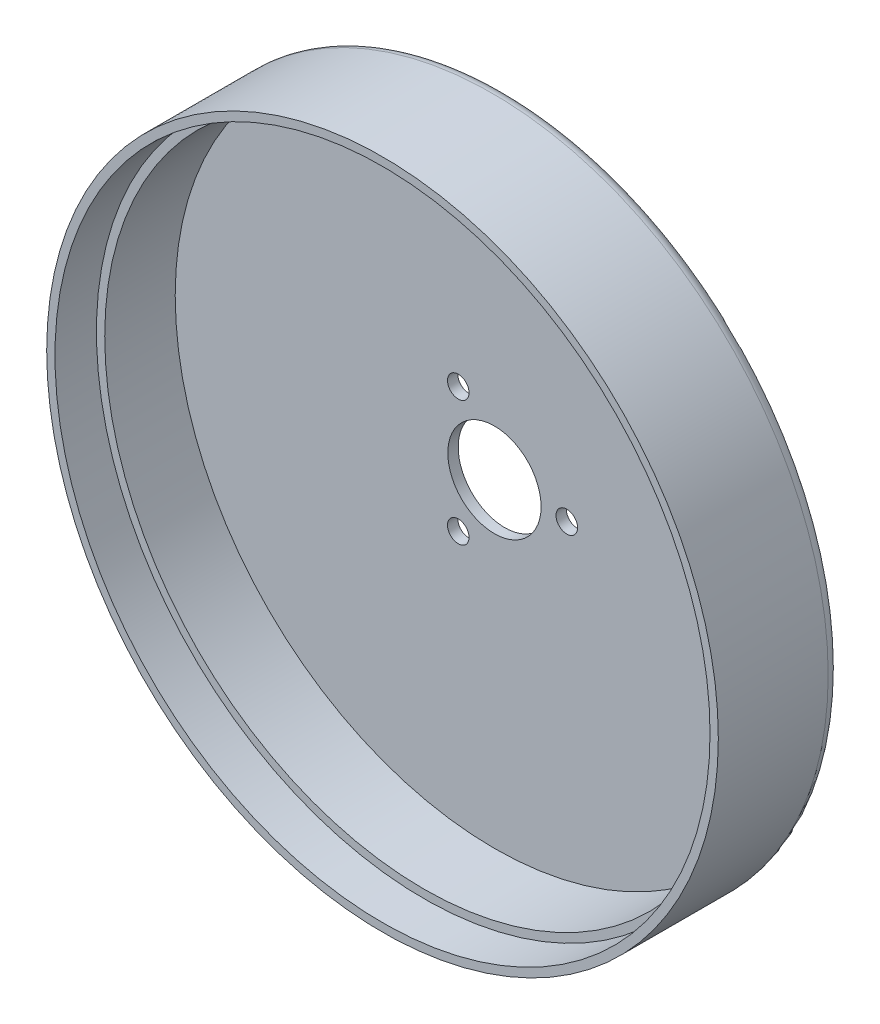
ISO-10303-21;
HEADER;
FILE_DESCRIPTION(('STEP AP214'),'2;1');
FILE_NAME('part.step','',(''),(''),'','','');
FILE_SCHEMA(('AUTOMOTIVE_DESIGN { 1 0 10303 214 1 1 1 1 }'));
ENDSEC;
DATA;
#1=APPLICATION_CONTEXT('core data for automotive mechanical design processes');
#2=APPLICATION_PROTOCOL_DEFINITION('international standard','automotive_design',2000,#1);
#3=PRODUCT_CONTEXT('',#1,'mechanical');
#4=PRODUCT('Part','Part','',(#3));
#5=PRODUCT_RELATED_PRODUCT_CATEGORY('part','',(#4));
#6=PRODUCT_DEFINITION_FORMATION('','',#4);
#7=PRODUCT_DEFINITION_CONTEXT('part definition',#1,'design');
#8=PRODUCT_DEFINITION('design','',#6,#7);
#9=PRODUCT_DEFINITION_SHAPE('','',#8);
#10=(LENGTH_UNIT() NAMED_UNIT(*) SI_UNIT(.MILLI.,.METRE.));
#11=(NAMED_UNIT(*) PLANE_ANGLE_UNIT() SI_UNIT($,.RADIAN.));
#12=(NAMED_UNIT(*) SI_UNIT($,.STERADIAN.) SOLID_ANGLE_UNIT());
#13=UNCERTAINTY_MEASURE_WITH_UNIT(LENGTH_MEASURE(1.E-05),#10,'distance_accuracy_value','');
#14=(GEOMETRIC_REPRESENTATION_CONTEXT(3) GLOBAL_UNCERTAINTY_ASSIGNED_CONTEXT((#13)) GLOBAL_UNIT_ASSIGNED_CONTEXT((#10,
#11,#12)) REPRESENTATION_CONTEXT('',''));
#15=CARTESIAN_POINT('',(0.,0.,0.));
#16=DIRECTION('',(0.,0.,1.));
#17=DIRECTION('',(1.,0.,0.));
#18=AXIS2_PLACEMENT_3D('',#15,#16,#17);
#19=CARTESIAN_POINT('',(0.,0.,29.5));
#20=DIRECTION('',(0.,0.,-1.));
#21=DIRECTION('',(-1.,0.,0.));
#22=AXIS2_PLACEMENT_3D('',#19,#20,#21);
#23=CYLINDRICAL_SURFACE('',#22,77.);
#24=CARTESIAN_POINT('',(0.,0.,2.5));
#25=DIRECTION('',(0.,0.,1.));
#26=DIRECTION('',(1.,0.,0.));
#27=AXIS2_PLACEMENT_3D('',#24,#25,#26);
#28=CIRCLE('',#27,77.);
#29=CARTESIAN_POINT('',(77.,0.,2.5));
#30=VERTEX_POINT('',#29);
#31=EDGE_CURVE('E43',#30,#30,#28,.F.);
#32=ORIENTED_EDGE('',*,*,#31,.T.);
#33=EDGE_LOOP('',(#32));
#34=FACE_BOUND('',#33,.T.);
#35=CARTESIAN_POINT('',(0.,0.,19.5));
#36=DIRECTION('',(0.,0.,1.));
#37=DIRECTION('',(1.,0.,0.));
#38=AXIS2_PLACEMENT_3D('',#35,#36,#37);
#39=CIRCLE('',#38,77.);
#40=CARTESIAN_POINT('',(77.,0.,19.5));
#41=VERTEX_POINT('',#40);
#42=EDGE_CURVE('E50',#41,#41,#39,.T.);
#43=ORIENTED_EDGE('',*,*,#42,.T.);
#44=EDGE_LOOP('',(#43));
#45=FACE_BOUND('',#44,.T.);
#46=ADVANCED_FACE('F32',(#34,#45),#23,.F.);
#47=CARTESIAN_POINT('',(0.,0.,2.5));
#48=DIRECTION('',(0.,0.,1.));
#49=DIRECTION('',(1.,0.,0.));
#50=AXIS2_PLACEMENT_3D('',#47,#48,#49);
#51=PLANE('',#50);
#52=CARTESIAN_POINT('',(0.,0.,2.5));
#53=DIRECTION('',(0.,0.,1.));
#54=DIRECTION('',(1.,0.,0.));
#55=AXIS2_PLACEMENT_3D('',#52,#53,#54);
#56=CIRCLE('',#55,11.25);
#57=CARTESIAN_POINT('',(11.25,0.,2.5));
#58=VERTEX_POINT('',#57);
#59=EDGE_CURVE('E55',#58,#58,#56,.T.);
#60=ORIENTED_EDGE('',*,*,#59,.F.);
#61=EDGE_LOOP('',(#60));
#62=FACE_BOUND('',#61,.T.);
#63=CARTESIAN_POINT('',(-8.72500000000007,-15.1121432960384,2.5));
#64=DIRECTION('',(0.,0.,1.));
#65=DIRECTION('',(1.,0.,0.));
#66=AXIS2_PLACEMENT_3D('',#63,#64,#65);
#67=CIRCLE('',#66,2.6);
#68=CARTESIAN_POINT('',(-6.12500000000007,-15.1121432960384,2.5));
#69=VERTEX_POINT('',#68);
#70=EDGE_CURVE('E61',#69,#69,#67,.T.);
#71=ORIENTED_EDGE('',*,*,#70,.F.);
#72=EDGE_LOOP('',(#71));
#73=FACE_BOUND('',#72,.T.);
#74=CARTESIAN_POINT('',(17.45,0.,2.5));
#75=DIRECTION('',(0.,0.,1.));
#76=DIRECTION('',(1.,0.,0.));
#77=AXIS2_PLACEMENT_3D('',#74,#75,#76);
#78=CIRCLE('',#77,2.6);
#79=CARTESIAN_POINT('',(20.05,0.,2.5));
#80=VERTEX_POINT('',#79);
#81=EDGE_CURVE('E67',#80,#80,#78,.T.);
#82=ORIENTED_EDGE('',*,*,#81,.F.);
#83=EDGE_LOOP('',(#82));
#84=FACE_BOUND('',#83,.T.);
#85=CARTESIAN_POINT('',(-8.72499999999997,15.1121432960385,2.5));
#86=DIRECTION('',(0.,0.,1.));
#87=DIRECTION('',(1.,0.,0.));
#88=AXIS2_PLACEMENT_3D('',#85,#86,#87);
#89=CIRCLE('',#88,2.6);
#90=CARTESIAN_POINT('',(-6.12499999999997,15.1121432960385,2.5));
#91=VERTEX_POINT('',#90);
#92=EDGE_CURVE('E73',#91,#91,#89,.T.);
#93=ORIENTED_EDGE('',*,*,#92,.F.);
#94=EDGE_LOOP('',(#93));
#95=FACE_BOUND('',#94,.T.);
#96=ORIENTED_EDGE('',*,*,#31,.F.);
#97=EDGE_LOOP('',(#96));
#98=FACE_BOUND('',#97,.T.);
#99=ADVANCED_FACE('F104',(#62,#73,#84,#95,#98),#51,.T.);
#100=CARTESIAN_POINT('',(0.,0.,2.5));
#101=DIRECTION('',(0.,0.,-1.));
#102=DIRECTION('',(-1.,0.,0.));
#103=AXIS2_PLACEMENT_3D('',#100,#101,#102);
#104=CYLINDRICAL_SURFACE('',#103,81.);
#105=CARTESIAN_POINT('',(0.,0.,3.));
#106=DIRECTION('',(0.,0.,1.));
#107=DIRECTION('',(1.,0.,0.));
#108=AXIS2_PLACEMENT_3D('',#105,#106,#107);
#109=CIRCLE('',#108,81.);
#110=CARTESIAN_POINT('',(81.,0.,3.));
#111=VERTEX_POINT('',#110);
#112=EDGE_CURVE('E39',#111,#111,#109,.T.);
#113=ORIENTED_EDGE('',*,*,#112,.T.);
#114=EDGE_LOOP('',(#113));
#115=FACE_BOUND('',#114,.T.);
#116=CARTESIAN_POINT('',(0.,0.,29.5));
#117=DIRECTION('',(0.,0.,1.));
#118=DIRECTION('',(1.,0.,0.));
#119=AXIS2_PLACEMENT_3D('',#116,#117,#118);
#120=CIRCLE('',#119,81.);
#121=CARTESIAN_POINT('',(81.,0.,29.5));
#122=VERTEX_POINT('',#121);
#123=EDGE_CURVE('E52',#122,#122,#120,.T.);
#124=ORIENTED_EDGE('',*,*,#123,.F.);
#125=EDGE_LOOP('',(#124));
#126=FACE_BOUND('',#125,.T.);
#127=ADVANCED_FACE('F101',(#115,#126),#104,.T.);
#128=CARTESIAN_POINT('',(0.,0.,0.));
#129=DIRECTION('',(0.,0.,1.));
#130=DIRECTION('',(1.,0.,0.));
#131=AXIS2_PLACEMENT_3D('',#128,#129,#130);
#132=PLANE('',#131);
#133=CARTESIAN_POINT('',(0.,0.,0.));
#134=DIRECTION('',(0.,0.,1.));
#135=DIRECTION('',(1.,0.,0.));
#136=AXIS2_PLACEMENT_3D('',#133,#134,#135);
#137=CIRCLE('',#136,78.);
#138=CARTESIAN_POINT('',(78.,0.,0.));
#139=VERTEX_POINT('',#138);
#140=EDGE_CURVE('E10',#139,#139,#137,.F.);
#141=ORIENTED_EDGE('',*,*,#140,.T.);
#142=EDGE_LOOP('',(#141));
#143=FACE_BOUND('',#142,.T.);
#144=CARTESIAN_POINT('',(-8.72499999999997,15.1121432960385,0.));
#145=DIRECTION('',(0.,0.,1.));
#146=DIRECTION('',(1.,0.,0.));
#147=AXIS2_PLACEMENT_3D('',#144,#145,#146);
#148=CIRCLE('',#147,2.6);
#149=CARTESIAN_POINT('',(-6.12499999999997,15.1121432960385,0.));
#150=VERTEX_POINT('',#149);
#151=EDGE_CURVE('E58',#150,#150,#148,.T.);
#152=ORIENTED_EDGE('',*,*,#151,.T.);
#153=EDGE_LOOP('',(#152));
#154=FACE_BOUND('',#153,.T.);
#155=CARTESIAN_POINT('',(17.45,0.,0.));
#156=DIRECTION('',(0.,0.,1.));
#157=DIRECTION('',(1.,0.,0.));
#158=AXIS2_PLACEMENT_3D('',#155,#156,#157);
#159=CIRCLE('',#158,2.6);
#160=CARTESIAN_POINT('',(20.05,0.,0.));
#161=VERTEX_POINT('',#160);
#162=EDGE_CURVE('E70',#161,#161,#159,.T.);
#163=ORIENTED_EDGE('',*,*,#162,.T.);
#164=EDGE_LOOP('',(#163));
#165=FACE_BOUND('',#164,.T.);
#166=CARTESIAN_POINT('',(-8.72500000000007,-15.1121432960384,0.));
#167=DIRECTION('',(0.,0.,1.));
#168=DIRECTION('',(1.,0.,0.));
#169=AXIS2_PLACEMENT_3D('',#166,#167,#168);
#170=CIRCLE('',#169,2.6);
#171=CARTESIAN_POINT('',(-6.12500000000007,-15.1121432960384,0.));
#172=VERTEX_POINT('',#171);
#173=EDGE_CURVE('E64',#172,#172,#170,.T.);
#174=ORIENTED_EDGE('',*,*,#173,.T.);
#175=EDGE_LOOP('',(#174));
#176=FACE_BOUND('',#175,.T.);
#177=CARTESIAN_POINT('',(0.,0.,0.));
#178=DIRECTION('',(0.,0.,1.));
#179=DIRECTION('',(1.,0.,0.));
#180=AXIS2_PLACEMENT_3D('',#177,#178,#179);
#181=CIRCLE('',#180,11.25);
#182=CARTESIAN_POINT('',(11.25,0.,0.));
#183=VERTEX_POINT('',#182);
#184=EDGE_CURVE('E47',#183,#183,#181,.T.);
#185=ORIENTED_EDGE('',*,*,#184,.T.);
#186=EDGE_LOOP('',(#185));
#187=FACE_BOUND('',#186,.T.);
#188=ADVANCED_FACE('F103',(#143,#154,#165,#176,#187),#132,.F.);
#189=CARTESIAN_POINT('',(0.,0.,0.));
#190=DIRECTION('',(0.,0.,1.));
#191=DIRECTION('',(1.,0.,0.));
#192=AXIS2_PLACEMENT_3D('',#189,#190,#191);
#193=CYLINDRICAL_SURFACE('',#192,11.25);
#194=ORIENTED_EDGE('',*,*,#184,.F.);
#195=EDGE_LOOP('',(#194));
#196=FACE_BOUND('',#195,.T.);
#197=ORIENTED_EDGE('',*,*,#59,.T.);
#198=EDGE_LOOP('',(#197));
#199=FACE_BOUND('',#198,.T.);
#200=ADVANCED_FACE('F109',(#196,#199),#193,.F.);
#201=CARTESIAN_POINT('',(-8.72500000000007,-15.1121432960384,0.));
#202=DIRECTION('',(0.,0.,1.));
#203=DIRECTION('',(1.,0.,0.));
#204=AXIS2_PLACEMENT_3D('',#201,#202,#203);
#205=CYLINDRICAL_SURFACE('',#204,2.6);
#206=ORIENTED_EDGE('',*,*,#173,.F.);
#207=EDGE_LOOP('',(#206));
#208=FACE_BOUND('',#207,.T.);
#209=ORIENTED_EDGE('',*,*,#70,.T.);
#210=EDGE_LOOP('',(#209));
#211=FACE_BOUND('',#210,.T.);
#212=ADVANCED_FACE('F127',(#208,#211),#205,.F.);
#213=CARTESIAN_POINT('',(17.45,0.,0.));
#214=DIRECTION('',(0.,0.,1.));
#215=DIRECTION('',(1.,0.,0.));
#216=AXIS2_PLACEMENT_3D('',#213,#214,#215);
#217=CYLINDRICAL_SURFACE('',#216,2.6);
#218=ORIENTED_EDGE('',*,*,#162,.F.);
#219=EDGE_LOOP('',(#218));
#220=FACE_BOUND('',#219,.T.);
#221=ORIENTED_EDGE('',*,*,#81,.T.);
#222=EDGE_LOOP('',(#221));
#223=FACE_BOUND('',#222,.T.);
#224=ADVANCED_FACE('F123',(#220,#223),#217,.F.);
#225=CARTESIAN_POINT('',(-8.72499999999997,15.1121432960385,0.));
#226=DIRECTION('',(0.,0.,1.));
#227=DIRECTION('',(1.,0.,0.));
#228=AXIS2_PLACEMENT_3D('',#225,#226,#227);
#229=CYLINDRICAL_SURFACE('',#228,2.6);
#230=ORIENTED_EDGE('',*,*,#151,.F.);
#231=EDGE_LOOP('',(#230));
#232=FACE_BOUND('',#231,.T.);
#233=ORIENTED_EDGE('',*,*,#92,.T.);
#234=EDGE_LOOP('',(#233));
#235=FACE_BOUND('',#234,.T.);
#236=ADVANCED_FACE('F97',(#232,#235),#229,.F.);
#237=CARTESIAN_POINT('',(0.,0.,29.5));
#238=DIRECTION('',(0.,0.,1.));
#239=DIRECTION('',(1.,0.,0.));
#240=AXIS2_PLACEMENT_3D('',#237,#238,#239);
#241=PLANE('',#240);
#242=CARTESIAN_POINT('',(0.,0.,29.5));
#243=DIRECTION('',(0.,0.,1.));
#244=DIRECTION('',(1.,0.,0.));
#245=AXIS2_PLACEMENT_3D('',#242,#243,#244);
#246=CIRCLE('',#245,79.);
#247=CARTESIAN_POINT('',(79.,0.,29.5));
#248=VERTEX_POINT('',#247);
#249=EDGE_CURVE('E80',#248,#248,#246,.T.);
#250=ORIENTED_EDGE('',*,*,#249,.F.);
#251=EDGE_LOOP('',(#250));
#252=FACE_BOUND('',#251,.T.);
#253=ORIENTED_EDGE('',*,*,#123,.T.);
#254=EDGE_LOOP('',(#253));
#255=FACE_BOUND('',#254,.T.);
#256=ADVANCED_FACE('F91',(#252,#255),#241,.T.);
#257=CARTESIAN_POINT('',(0.,0.,19.5));
#258=DIRECTION('',(0.,0.,1.));
#259=DIRECTION('',(1.,0.,0.));
#260=AXIS2_PLACEMENT_3D('',#257,#258,#259);
#261=CYLINDRICAL_SURFACE('',#260,79.);
#262=CARTESIAN_POINT('',(0.,0.,19.5));
#263=DIRECTION('',(0.,0.,1.));
#264=DIRECTION('',(1.,0.,0.));
#265=AXIS2_PLACEMENT_3D('',#262,#263,#264);
#266=CIRCLE('',#265,79.);
#267=CARTESIAN_POINT('',(79.,0.,19.5));
#268=VERTEX_POINT('',#267);
#269=EDGE_CURVE('E53',#268,#268,#266,.T.);
#270=ORIENTED_EDGE('',*,*,#269,.F.);
#271=EDGE_LOOP('',(#270));
#272=FACE_BOUND('',#271,.T.);
#273=ORIENTED_EDGE('',*,*,#249,.T.);
#274=EDGE_LOOP('',(#273));
#275=FACE_BOUND('',#274,.T.);
#276=ADVANCED_FACE('F88',(#272,#275),#261,.F.);
#277=CARTESIAN_POINT('',(0.,0.,19.5));
#278=DIRECTION('',(0.,0.,1.));
#279=DIRECTION('',(1.,0.,0.));
#280=AXIS2_PLACEMENT_3D('',#277,#278,#279);
#281=PLANE('',#280);
#282=ORIENTED_EDGE('',*,*,#42,.F.);
#283=EDGE_LOOP('',(#282));
#284=FACE_BOUND('',#283,.T.);
#285=ORIENTED_EDGE('',*,*,#269,.T.);
#286=EDGE_LOOP('',(#285));
#287=FACE_BOUND('',#286,.T.);
#288=ADVANCED_FACE('F86',(#284,#287),#281,.T.);
#289=CARTESIAN_POINT('',(0.,0.,3.));
#290=DIRECTION('',(0.,0.,1.));
#291=DIRECTION('',(1.,0.,0.));
#292=AXIS2_PLACEMENT_3D('',#289,#290,#291);
#293=TOROIDAL_SURFACE('',#292,78.,3.);
#294=ORIENTED_EDGE('',*,*,#140,.F.);
#295=EDGE_LOOP('',(#294));
#296=FACE_BOUND('',#295,.T.);
#297=ORIENTED_EDGE('',*,*,#112,.F.);
#298=EDGE_LOOP('',(#297));
#299=FACE_BOUND('',#298,.T.);
#300=ADVANCED_FACE('F34',(#296,#299),#293,.T.);
#301=CLOSED_SHELL('',(#46,#99,#127,#188,#200,#212,#224,#236,#256,#276,#288,#300));
#302=MANIFOLD_SOLID_BREP('B2',#301);
#303=ADVANCED_BREP_SHAPE_REPRESENTATION('',(#18,#302),#14);
#304=SHAPE_DEFINITION_REPRESENTATION(#9,#303);
ENDSEC;
END-ISO-10303-21;
